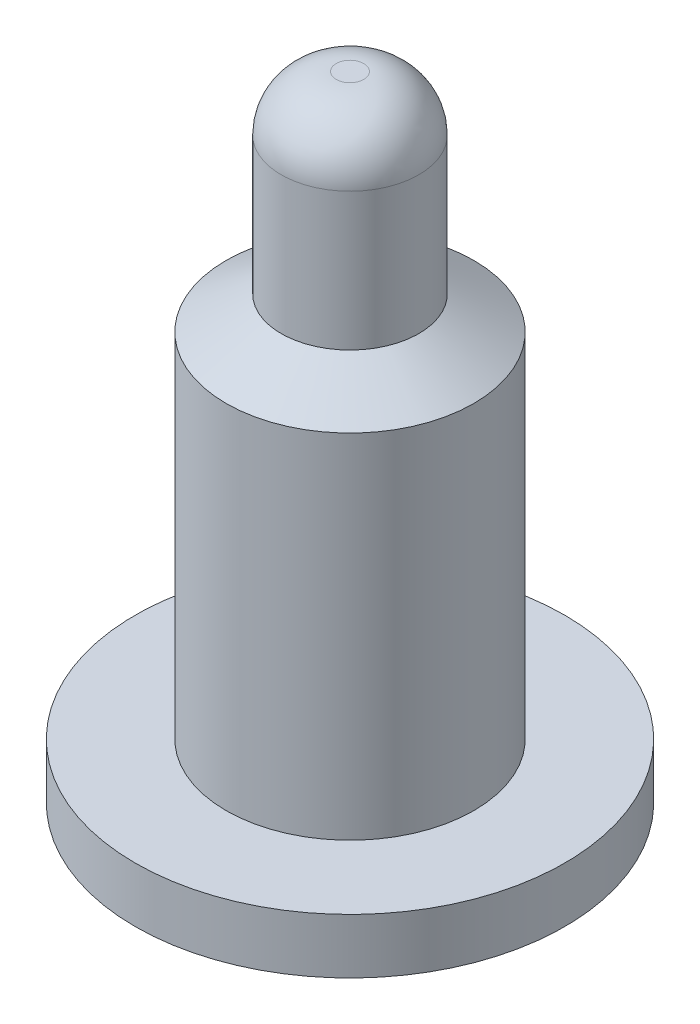
ISO-10303-21;
HEADER;
FILE_DESCRIPTION(('STEP AP214'),'2;1');
FILE_NAME('part.step','',(''),(''),'','','');
FILE_SCHEMA(('AUTOMOTIVE_DESIGN { 1 0 10303 214 1 1 1 1 }'));
ENDSEC;
DATA;
#1=APPLICATION_CONTEXT('core data for automotive mechanical design processes');
#2=APPLICATION_PROTOCOL_DEFINITION('international standard','automotive_design',2000,#1);
#3=PRODUCT_CONTEXT('',#1,'mechanical');
#4=PRODUCT('Part','Part','',(#3));
#5=PRODUCT_RELATED_PRODUCT_CATEGORY('part','',(#4));
#6=PRODUCT_DEFINITION_FORMATION('','',#4);
#7=PRODUCT_DEFINITION_CONTEXT('part definition',#1,'design');
#8=PRODUCT_DEFINITION('design','',#6,#7);
#9=PRODUCT_DEFINITION_SHAPE('','',#8);
#10=(LENGTH_UNIT() NAMED_UNIT(*) SI_UNIT(.MILLI.,.METRE.));
#11=(NAMED_UNIT(*) PLANE_ANGLE_UNIT() SI_UNIT($,.RADIAN.));
#12=(NAMED_UNIT(*) SI_UNIT($,.STERADIAN.) SOLID_ANGLE_UNIT());
#13=UNCERTAINTY_MEASURE_WITH_UNIT(LENGTH_MEASURE(1.E-05),#10,'distance_accuracy_value','');
#14=(GEOMETRIC_REPRESENTATION_CONTEXT(3) GLOBAL_UNCERTAINTY_ASSIGNED_CONTEXT((#13)) GLOBAL_UNIT_ASSIGNED_CONTEXT((#10,
#11,#12)) REPRESENTATION_CONTEXT('',''));
#15=CARTESIAN_POINT('',(0.,0.,0.));
#16=DIRECTION('',(0.,0.,1.));
#17=DIRECTION('',(1.,0.,0.));
#18=AXIS2_PLACEMENT_3D('',#15,#16,#17);
#19=CARTESIAN_POINT('',(0.,7.,0.));
#20=DIRECTION('',(0.,-1.,0.));
#21=DIRECTION('',(0.,0.,-1.));
#22=AXIS2_PLACEMENT_3D('',#19,#20,#21);
#23=PLANE('',#22);
#24=CARTESIAN_POINT('',(0.,7.0000000000004,0.125));
#25=CARTESIAN_POINT('',(-0.0011845763240586,6.99999999988191,0.124990961362247));
#26=CARTESIAN_POINT('',(-0.00236915464220974,6.9999999997948,0.124969367235018));
#27=CARTESIAN_POINT('',(-0.00467396676152806,6.99999999967586,0.124898871048834));
#28=CARTESIAN_POINT('',(-0.00579424827911599,6.99999999964133,0.124851493742099));
#29=CARTESIAN_POINT('',(-0.00838523720634593,6.99999999960475,0.124707464938616));
#30=CARTESIAN_POINT('',(-0.00985536267512346,6.99999999961635,0.124600003714444));
#31=CARTESIAN_POINT('',(-0.0131421602191902,6.9999999996706,0.124302262963767));
#32=CARTESIAN_POINT('',(-0.0149575966198639,6.99999999972,0.124098320638822));
#33=CARTESIAN_POINT('',(-0.0189275544439451,6.99999999983138,0.123564621897024));
#34=CARTESIAN_POINT('',(-0.0210798690246219,6.99999999989394,0.12321817648695));
#35=CARTESIAN_POINT('',(-0.0244224505183593,6.99999999996235,0.122590560941277));
#36=CARTESIAN_POINT('',(-0.025620031755405,6.99999999998104,0.122347561068465));
#37=CARTESIAN_POINT('',(-0.0280938146535721,7.00000000000238,0.121807885591586));
#38=CARTESIAN_POINT('',(-0.0293694505172907,7.00000000000378,0.121508601438896));
#39=CARTESIAN_POINT('',(-0.0319962853336742,6.99999999998117,0.120848718156185));
#40=CARTESIAN_POINT('',(-0.0333467876746052,6.99999999995544,0.120485347137127));
#41=CARTESIAN_POINT('',(-0.0361197149372673,6.99999999986729,0.119689274592767));
#42=CARTESIAN_POINT('',(-0.0375413002313309,6.99999999980266,0.119253644931036));
#43=CARTESIAN_POINT('',(-0.0404519786717943,6.99999999962623,0.118304701302308));
#44=CARTESIAN_POINT('',(-0.0419400685095645,6.99999999951187,0.117788310608784));
#45=CARTESIAN_POINT('',(-0.0449786525532337,6.99999999921463,0.116669335696142));
#46=CARTESIAN_POINT('',(-0.0465279685039721,6.99999999902827,0.116063542344182));
#47=CARTESIAN_POINT('',(-0.0489005381865657,6.99999999870806,0.115080643741477));
#48=CARTESIAN_POINT('',(-0.0497328176482096,6.999999998589,0.114725175860613));
#49=CARTESIAN_POINT('',(-0.0513893625458782,6.99999999836219,0.113995963399204));
#50=CARTESIAN_POINT('',(-0.0522136277080706,6.99999999825443,0.113622218196771));
#51=CARTESIAN_POINT('',(-0.0546738419752109,6.99999999795161,0.112473906613656));
#52=CARTESIAN_POINT('',(-0.0562972461882234,6.99999999777697,0.111672249208305));
#53=CARTESIAN_POINT('',(-0.0595072112858007,6.9999999975202,0.109998300300352));
#54=CARTESIAN_POINT('',(-0.0610937710172099,6.99999999743809,0.109126006590805));
#55=CARTESIAN_POINT('',(-0.0642270161640972,6.9999999973804,0.107312469694172));
#56=CARTESIAN_POINT('',(-0.0657737013124425,6.99999999740482,0.10637122604533));
#57=CARTESIAN_POINT('',(-0.0688241401012372,6.99999999755604,0.104421635492604));
#58=CARTESIAN_POINT('',(-0.0703278945079322,6.99999999768284,0.103413289787456));
#59=CARTESIAN_POINT('',(-0.0732895447011516,6.99999999801512,0.101331485761408));
#60=CARTESIAN_POINT('',(-0.0747474424301756,6.9999999982206,0.100258030204234));
#61=CARTESIAN_POINT('',(-0.0776144747865431,6.99999999866673,0.0980480662654198));
#62=CARTESIAN_POINT('',(-0.0790236126733884,6.99999999890739,0.0969115621117316));
#63=CARTESIAN_POINT('',(-0.0817905532499704,6.99999999936284,0.0945779237775702));
#64=CARTESIAN_POINT('',(-0.0831483606272363,6.99999999957763,0.0933807951568281));
#65=CARTESIAN_POINT('',(-0.0858093041461507,6.99999999989412,0.0909275676615827));
#66=CARTESIAN_POINT('',(-0.0871124466175158,6.99999999999583,0.0896714756504126));
#67=CARTESIAN_POINT('',(-0.089654805556031,7.00000000000493,0.087114716257146));
#68=CARTESIAN_POINT('',(-0.0908944237664505,6.99999999991374,0.0858144475884495));
#69=CARTESIAN_POINT('',(-0.093320504127623,6.9999999998582,0.0831653253676784));
#70=CARTESIAN_POINT('',(-0.094506968019664,6.99999999989383,0.0818164734097643));
#71=CARTESIAN_POINT('',(-0.0968242369406126,6.99999999999718,0.0790715661815917));
#72=CARTESIAN_POINT('',(-0.0979550371830363,7.00000000006491,0.0776755068693528));
#73=CARTESIAN_POINT('',(-0.100159443243098,6.99999999974125,0.0748384860651377));
#74=CARTESIAN_POINT('',(-0.101233037320516,6.99999999934977,0.0733975154516106));
#75=CARTESIAN_POINT('',(-0.103321280511592,6.99999999726854,0.0704727822091094));
#76=CARTESIAN_POINT('',(-0.104335910475358,6.99999999557838,0.0689890059095889));
#77=CARTESIAN_POINT('',(-0.10630479794021,6.99999998950278,0.065980961195197));
#78=CARTESIAN_POINT('',(-0.10725902859527,6.99999998511616,0.064456675196236));
#79=CARTESIAN_POINT('',(-0.109105052034446,6.99999997248513,0.061369676735883));
#80=CARTESIAN_POINT('',(-0.109996809575706,6.99999996423855,0.0598069432461768));
#81=CARTESIAN_POINT('',(-0.11171850094258,6.9999999399989,0.0566461857423396));
#82=CARTESIAN_POINT('',(-0.11254839245982,6.99999992400058,0.0550481385290861));
#83=CARTESIAN_POINT('',(-0.11373987692198,6.99999989753268,0.0526245992171599));
#84=CARTESIAN_POINT('',(-0.11412826067706,6.99999988829499,0.0518120801598112));
#85=CARTESIAN_POINT('',(-0.114896803551761,6.99999985985858,0.0501824328824294));
#86=CARTESIAN_POINT('',(-0.115276959087988,6.9999998406556,0.0493653028421262));
#87=CARTESIAN_POINT('',(-0.115877739026522,6.9999998297595,0.0479699222870799));
#88=CARTESIAN_POINT('',(-0.116110996847834,6.99999983132602,0.0473971515457563));
#89=CARTESIAN_POINT('',(-0.116814567970092,6.99999983945525,0.0456214752827771));
#90=CARTESIAN_POINT('',(-0.117266497309626,6.99999984960056,0.044411413422559));
#91=CARTESIAN_POINT('',(-0.118356326708186,6.99999987511897,0.0413436488613062));
#92=CARTESIAN_POINT('',(-0.118968545772131,6.99999989046378,0.0394767696078323));
#93=CARTESIAN_POINT('',(-0.120087667556273,6.99999991900967,0.0357639074901598));
#94=CARTESIAN_POINT('',(-0.120596868470112,6.99999993225562,0.0339186165126956));
#95=CARTESIAN_POINT('',(-0.121330630140748,6.99999995055333,0.0309974676448174));
#96=CARTESIAN_POINT('',(-0.121584027797007,6.99999995669174,0.0299287721797843));
#97=CARTESIAN_POINT('',(-0.122082580470595,6.99999996839581,0.0276930973950104));
#98=CARTESIAN_POINT('',(-0.12232516806938,6.99999997386731,0.0265255440863818));
#99=CARTESIAN_POINT('',(-0.122831097422406,6.99999998415258,0.0239072017143752));
#100=CARTESIAN_POINT('',(-0.123085778100579,6.99999998850474,0.0224547340366339));
#101=CARTESIAN_POINT('',(-0.123531896262788,6.99999999461784,0.0196360034349208));
#102=CARTESIAN_POINT('',(-0.123726350165895,6.99999999652759,0.0182702122010476));
#103=CARTESIAN_POINT('',(-0.124210627791376,7.00000000001083,0.0144465917821842));
#104=CARTESIAN_POINT('',(-0.124453604628784,7.00000000011367,0.0119826264115812));
#105=CARTESIAN_POINT('',(-0.124752108663787,6.9999999998358,0.00781070202283271));
#106=CARTESIAN_POINT('',(-0.124842390484822,6.99999999959505,0.00610506987974079));
#107=CARTESIAN_POINT('',(-0.12495789277335,6.99999999974292,0.00293285942866736));
#108=CARTESIAN_POINT('',(-0.124990502143336,7.00000000004744,0.00146654632544861));
#109=CARTESIAN_POINT('',(-0.12501177615309,6.99999999994207,-0.00181833382563368));
#110=CARTESIAN_POINT('',(-0.124988023219213,6.99999999934327,-0.00363702618135456));
#111=CARTESIAN_POINT('',(-0.124856913595364,6.99999999721432,-0.00727199614741167));
#112=CARTESIAN_POINT('',(-0.124749531331044,6.99999999568387,-0.00908827284880145));
#113=CARTESIAN_POINT('',(-0.124454707859988,6.99999999211747,-0.01271476160528));
#114=CARTESIAN_POINT('',(-0.124267245236631,6.99999999008138,-0.0145249719073591));
#115=CARTESIAN_POINT('',(-0.12381169283881,6.99999998579495,-0.0181356607158447));
#116=CARTESIAN_POINT('',(-0.12354358458493,6.99999998354455,-0.01993613689538));
#117=CARTESIAN_POINT('',(-0.122927489420184,6.99999997909643,-0.0235237164748269));
#118=CARTESIAN_POINT('',(-0.122579487257776,6.99999997689872,-0.0253108172540613));
#119=CARTESIAN_POINT('',(-0.121804212715411,6.99999997276904,-0.0288680295791156));
#120=CARTESIAN_POINT('',(-0.121376928229742,6.99999997083711,-0.030638138486957));
#121=CARTESIAN_POINT('',(-0.120443946239791,6.99999996740612,-0.0341577855203438));
#122=CARTESIAN_POINT('',(-0.119938239755309,6.99999996590711,-0.0359073212653162));
#123=CARTESIAN_POINT('',(-0.118849413358962,6.99999996346099,-0.0393822823917395));
#124=CARTESIAN_POINT('',(-0.118266287536528,6.99999996251392,-0.0411077059212189));
#125=CARTESIAN_POINT('',(-0.117023790355667,6.9999999612432,-0.0445309528536316));
#126=CARTESIAN_POINT('',(-0.116364416086154,6.99999996091957,-0.0462287751999555));
#127=CARTESIAN_POINT('',(-0.114970748155263,6.99999996091957,-0.0495933872826275));
#128=CARTESIAN_POINT('',(-0.114236454493886,6.9999999612432,-0.0512601770189756));
#129=CARTESIAN_POINT('',(-0.112694431481029,6.99999996251392,-0.054559356253058));
#130=CARTESIAN_POINT('',(-0.111886704935138,6.99999996346098,-0.0561917470621108));
#131=CARTESIAN_POINT('',(-0.11019945314434,6.99999996590712,-0.0594188324198195));
#132=CARTESIAN_POINT('',(-0.109319933388345,6.99999996740614,-0.0610135298383046));
#133=CARTESIAN_POINT('',(-0.107490884040403,6.99999997083709,-0.0641620130727789));
#134=CARTESIAN_POINT('',(-0.106541362481924,6.99999997276896,-0.0657158035555962));
#135=CARTESIAN_POINT('',(-0.104574238972924,6.99999997689879,-0.0687793379140028));
#136=CARTESIAN_POINT('',(-0.103556647446824,6.9999999790967,-0.0702890884833609));
#137=CARTESIAN_POINT('',(-0.101455477377251,6.99999998354428,-0.073261522285771));
#138=CARTESIAN_POINT('',(-0.100371911475743,6.99999998579395,-0.0747242144545324));
#139=CARTESIAN_POINT('',(-0.098140942706995,6.99999999008239,-0.0775995301168326));
#140=CARTESIAN_POINT('',(-0.096993554532334,6.99999999212122,-0.0790121650125156));
#141=CARTESIAN_POINT('',(-0.0946375264377593,6.99999999568012,-0.0817847689313832));
#142=CARTESIAN_POINT('',(-0.0934289029869628,6.99999999720032,-0.0831447519434289));
#143=CARTESIAN_POINT('',(-0.0909519896390017,6.99999999935726,-0.08580845335434));
#144=CARTESIAN_POINT('',(-0.0896837181028242,6.99999999999426,-0.0871121888335506));
#145=CARTESIAN_POINT('',(-0.0871163337875572,7.00000000000642,-0.089641496270993));
#146=CARTESIAN_POINT('',(-0.0858181894298551,6.99999999940413,-0.0908680537236018));
#147=CARTESIAN_POINT('',(-0.0831751397817974,6.99999999817731,-0.0932690667318865));
#148=CARTESIAN_POINT('',(-0.0818302452150231,6.99999999755278,-0.0944435340971621));
#149=CARTESIAN_POINT('',(-0.0790948081053531,6.99999999686783,-0.0967378380313501));
#150=CARTESIAN_POINT('',(-0.0777042694153862,6.99999999680735,-0.0978576791916524));
#151=CARTESIAN_POINT('',(-0.0748797479053537,6.99999999733549,-0.100041308550285));
#152=CARTESIAN_POINT('',(-0.0734457625029252,6.99999999792415,-0.101105093406435));
#153=CARTESIAN_POINT('',(-0.07053643596607,6.99999999908489,-0.103175243349613));
#154=CARTESIAN_POINT('',(-0.0690610864834311,6.99999999965698,-0.104181596719432));
#155=CARTESIAN_POINT('',(-0.0660707805647611,7.00000000025959,-0.106134564816066));
#156=CARTESIAN_POINT('',(-0.0645558105643215,7.00000000028993,-0.10708115869484));
#157=CARTESIAN_POINT('',(-0.0614897685244681,6.99999999610883,-0.108916425643709));
#158=CARTESIAN_POINT('',(-0.0599386791424029,6.99999999189532,-0.109805070077456));
#159=CARTESIAN_POINT('',(-0.0567974878541885,6.99999998473228,-0.11151103925575));
#160=CARTESIAN_POINT('',(-0.0552073618461242,6.99999998178354,-0.11232831844315));
#161=CARTESIAN_POINT('',(-0.0520093790933695,6.99999994561689,-0.113935331696741));
#162=CARTESIAN_POINT('',(-0.0504015095353135,6.99999991237545,-0.114725043873401));
#163=CARTESIAN_POINT('',(-0.0483574549431161,6.99999991698706,-0.115580670707735));
#164=CARTESIAN_POINT('',(-0.047961409967924,6.99999991997773,-0.115739816049636));
#165=CARTESIAN_POINT('',(-0.0464378152247606,6.99999993068556,-0.116344151016213));
#166=CARTESIAN_POINT('',(-0.0453053779900423,6.99999993697224,-0.116776764113934));
#167=CARTESIAN_POINT('',(-0.0422908000548951,6.99999995312389,-0.117876563667241));
#168=CARTESIAN_POINT('',(-0.0403978014923146,6.99999996267137,-0.118514354341029));
#169=CARTESIAN_POINT('',(-0.0365693927194749,6.99999997842303,-0.119703589639662));
#170=CARTESIAN_POINT('',(-0.0346337709455264,6.99999998460162,-0.120254351084104));
#171=CARTESIAN_POINT('',(-0.0315523864108214,6.9999999920339,-0.12105114395142));
#172=CARTESIAN_POINT('',(-0.0304146074382847,6.99999999426668,-0.121328331566643));
#173=CARTESIAN_POINT('',(-0.0280245159312249,6.99999999782931,-0.121874805571143));
#174=CARTESIAN_POINT('',(-0.0267714739396776,6.99999999905479,-0.122140910123186));
#175=CARTESIAN_POINT('',(-0.0241188215030493,7.00000000023349,-0.122663275358711));
#176=CARTESIAN_POINT('',(-0.0227183536791854,7.0000000000307,-0.122915178859951));
#177=CARTESIAN_POINT('',(-0.0199850187174355,6.99999999886957,-0.123363069949293));
#178=CARTESIAN_POINT('',(-0.0186525184422735,6.999999997952,-0.123561319158935));
#179=CARTESIAN_POINT('',(-0.0148714576697602,6.99999999545753,-0.124067257454162));
#180=CARTESIAN_POINT('',(-0.012416541567566,6.99999999396708,-0.124328804125145));
#181=CARTESIAN_POINT('',(-0.0082048028349713,6.99999999457408,-0.124668544127081));
#182=CARTESIAN_POINT('',(-0.00645035497895921,6.99999999576257,-0.124777840564063));
#183=CARTESIAN_POINT('',(-0.00313051930415646,6.99999999815936,-0.124928034492128));
#184=CARTESIAN_POINT('',(-0.0015654110968393,6.99999999935131,-0.12497509870089));
#185=CARTESIAN_POINT('',(0.,7.0000000000004,-0.125));
#186=B_SPLINE_CURVE_WITH_KNOTS('',3,(#24,#25,#26,#27,#28,#29,#30,#31,#32,#33,#34,#35,#36,#37,
#38,#39,#40,#41,#42,#43,#44,#45,#46,#47,#48,#49,#50,#51,#52,#53,#54,#55,#56,#57,#58,#59,#60,#61,
#62,#63,#64,#65,#66,#67,#68,#69,#70,#71,#72,#73,#74,#75,#76,#77,#78,#79,#80,#81,#82,#83,#84,#85,
#86,#87,#88,#89,#90,#91,#92,#93,#94,#95,#96,#97,#98,#99,#100,#101,#102,#103,#104,#105,#106,#107,
#108,#109,#110,#111,#112,#113,#114,#115,#116,#117,#118,#119,#120,#121,#122,#123,#124,#125,#126,
#127,#128,#129,#130,#131,#132,#133,#134,#135,#136,#137,#138,#139,#140,#141,#142,#143,#144,#145,
#146,#147,#148,#149,#150,#151,#152,#153,#154,#155,#156,#157,#158,#159,#160,#161,#162,#163,#164,
#165,#166,#167,#168,#169,#170,#171,#172,#173,#174,#175,#176,#177,#178,#179,#180,#181,#182,#183,
#184,#185),.UNSPECIFIED.,.F.,.F.,(4,2,2,2,2,2,2,2,2,2,2,2,2,2,2,2,2,2,2,2,2,2,2,2,2,2,2,2,2,2,2,
2,2,2,2,2,2,2,2,2,2,2,2,2,2,2,2,2,2,2,2,2,2,2,2,2,2,2,2,2,2,2,2,2,2,2,2,2,2,2,2,2,2,2,2,2,2,2,2,
2,4),(0.,0.00355390411559182,0.00691743798368023,0.0113386471174511,0.0168175827364344,
0.0233543627285268,0.0270198879525032,0.0309500404898857,0.0351448672752296,0.0396044203684168,
0.0443287569566394,0.0493179393557704,0.0520327805529687,0.0547477141870433,0.0601774635948827,
0.065607382714166,0.0710373382008164,0.0764671967106953,0.0818968248998665,0.0873260894248601,
0.0927548569429374,0.098182994112356,0.103570956874667,0.108958743002874,0.114346991617169,
0.119736341816988,0.125127432655956,0.130520903116892,0.13591739208692,0.141317538332715,
0.144019321234146,0.146722258006213,0.148577240067705,0.152451695231184,0.158343375423983,
0.164083964140989,0.167378598079147,0.170955578819889,0.175378552177074,0.179516713680765,
0.186940183340825,0.19206332276448,0.196462786404626,0.201917570486593,0.207374023329347,
0.212831936355501,0.218291100980567,0.223751308613983,0.229212350660132,0.234674018519359,
0.240136103588984,0.245598397264312,0.251060690939641,0.256522776009267,0.261984443868495,
0.267445485914645,0.272905693548063,0.278364858173132,0.283822771199289,0.289279224042046,
0.294734008124016,0.300090437966607,0.30544564715337,0.310800405450874,0.316155482648512,
0.32151164851493,0.326869672754487,0.332230324963836,0.337594374588694,0.342962590880901,
0.344242898668081,0.347879380970134,0.353869438706628,0.359904403721428,0.363417152122189,
0.367259506767069,0.371527572630726,0.375568600504453,0.382971094944192,0.388243687709725,
0.392940409915569),.UNSPECIFIED.);
#187=CARTESIAN_POINT('',(0.,7.0000000000004,0.125));
#188=VERTEX_POINT('',#187);
#189=CARTESIAN_POINT('',(3.86355083801407E-09,7.00000000000037,-0.124999999937322));
#190=VERTEX_POINT('',#189);
#191=EDGE_CURVE('E35',#188,#190,#186,.T.);
#192=ORIENTED_EDGE('',*,*,#191,.F.);
#193=CARTESIAN_POINT('',(0.,7.0000000000004,-0.125));
#194=CARTESIAN_POINT('',(0.000863166943270553,6.99999999991643,-0.124993122554638));
#195=CARTESIAN_POINT('',(0.00172638667744423,6.99999999984802,-0.124979642854253));
#196=CARTESIAN_POINT('',(0.00439679475173449,6.9999999996791,-0.124915111537449));
#197=CARTESIAN_POINT('',(0.00620346743626927,6.99999999962535,-0.124839088510162));
#198=CARTESIAN_POINT('',(0.00926319873397888,6.99999999960966,-0.124643234697517));
#199=CARTESIAN_POINT('',(0.0105175730129968,6.99999999962478,-0.124543750114273));
#200=CARTESIAN_POINT('',(0.0132579884125726,6.99999999967546,-0.12428561518772));
#201=CARTESIAN_POINT('',(0.0147433184910543,6.99999999971432,-0.124119364247846));
#202=CARTESIAN_POINT('',(0.0179413727134722,6.99999999980303,-0.123703603183831));
#203=CARTESIAN_POINT('',(0.0196529308406049,6.99999999985363,-0.123445086557312));
#204=CARTESIAN_POINT('',(0.0232967796132941,6.9999999999433,-0.122817538369758));
#205=CARTESIAN_POINT('',(0.0252273078431152,6.99999999997986,-0.122438237906049));
#206=CARTESIAN_POINT('',(0.0292991447207724,7.00000000000983,-0.121538316288853));
#207=CARTESIAN_POINT('',(0.031437912589598,6.99999999999754,-0.12100619165966));
#208=CARTESIAN_POINT('',(0.0359124311349919,6.99999999988601,-0.119766824104908));
#209=CARTESIAN_POINT('',(0.0382446990156076,6.99999999977758,-0.119046918701741));
#210=CARTESIAN_POINT('',(0.041792228297626,6.99999999952001,-0.117837320643738));
#211=CARTESIAN_POINT('',(0.043024078645989,6.99999999941304,-0.117395623935314));
#212=CARTESIAN_POINT('',(0.0455287617709962,6.99999999914914,-0.116453089072085));
#213=CARTESIAN_POINT('',(0.0468009306706703,6.99999999899016,-0.115950480247219));
#214=CARTESIAN_POINT('',(0.0494325667083838,6.99999999863762,-0.114860215921872));
#215=CARTESIAN_POINT('',(0.0507905449628178,6.99999999844228,-0.114268964430852));
#216=CARTESIAN_POINT('',(0.0534843659722467,6.99999999809111,-0.113037849431325));
#217=CARTESIAN_POINT('',(0.0548202076321696,6.99999999793529,-0.112397983526611));
#218=CARTESIAN_POINT('',(0.0574680515097069,6.99999999767597,-0.111070591384003));
#219=CARTESIAN_POINT('',(0.0587800529420403,6.99999999757246,-0.110383063579737));
#220=CARTESIAN_POINT('',(0.0613784796106221,6.99999999743318,-0.108961215546125));
#221=CARTESIAN_POINT('',(0.0626649044260574,6.99999999739741,-0.108226894547724));
#222=CARTESIAN_POINT('',(0.0652104922312693,6.99999999739731,-0.106712430149247));
#223=CARTESIAN_POINT('',(0.0664696552210426,6.99999999743298,-0.105932286749165));
#224=CARTESIAN_POINT('',(0.068959067666152,6.99999999757162,-0.104327200555979));
#225=CARTESIAN_POINT('',(0.0701893175964556,6.99999999767459,-0.10350225849954));
#226=CARTESIAN_POINT('',(0.0726192849406385,6.9999999979347,-0.10180865368851));
#227=CARTESIAN_POINT('',(0.0738190033570518,6.99999999809183,-0.100939992372284));
#228=CARTESIAN_POINT('',(0.076186357023123,6.99999999843894,-0.0991601133166216));
#229=CARTESIAN_POINT('',(0.077353993852185,6.99999999862891,-0.0982488976781559));
#230=CARTESIAN_POINT('',(0.07965557410639,6.99999999900998,-0.0963850286247508));
#231=CARTESIAN_POINT('',(0.0807895197422413,6.99999999920108,-0.0954323779387983));
#232=CARTESIAN_POINT('',(0.0830225367678941,6.99999999955039,-0.0934871972742383));
#233=CARTESIAN_POINT('',(0.0841216110169821,6.99999999970862,-0.092494670580475));
#234=CARTESIAN_POINT('',(0.0862823185965877,6.9999999999256,-0.0904699158492117));
#235=CARTESIAN_POINT('',(0.0873439556102447,6.99999999998437,-0.0894376917382181));
#236=CARTESIAN_POINT('',(0.0894414245094089,7.00000000001656,-0.0873302775557568));
#237=CARTESIAN_POINT('',(0.0904769683952516,6.99999999998927,-0.0862548015721313));
#238=CARTESIAN_POINT('',(0.0925162467687964,7.00000000000659,-0.0840740383568251));
#239=CARTESIAN_POINT('',(0.0935199779713686,7.00000000005121,-0.0829687480680509));
#240=CARTESIAN_POINT('',(0.096482365127324,6.99999999829381,-0.0796070830881871));
#241=CARTESIAN_POINT('',(0.0983910959860125,6.99999999459849,-0.0773060404290494));
#242=CARTESIAN_POINT('',(0.100916315182364,6.99999997053877,-0.074064435950632));
#243=CARTESIAN_POINT('',(0.101595323399934,6.99999996202695,-0.0731717720486683));
#244=CARTESIAN_POINT('',(0.102937012441274,6.99999993539225,-0.0713730418533025));
#245=CARTESIAN_POINT('',(0.103599680410243,6.99999991726205,-0.0704669658523778));
#246=CARTESIAN_POINT('',(0.104890875233769,6.99999988254626,-0.0686318059807541));
#247=CARTESIAN_POINT('',(0.10551943096373,6.99999986595936,-0.0677027425700496));
#248=CARTESIAN_POINT('',(0.106962692179925,6.9999998368789,-0.0654797609207533));
#249=CARTESIAN_POINT('',(0.107762070706407,6.99999982806134,-0.0641759082919027));
#250=CARTESIAN_POINT('',(0.109300649928862,6.99999981593216,-0.0615475683497284));
#251=CARTESIAN_POINT('',(0.110040285280359,6.99999981257656,-0.0602233334246623));
#252=CARTESIAN_POINT('',(0.111588925032127,6.99999981025265,-0.0573163690176891));
#253=CARTESIAN_POINT('',(0.112388005797892,6.99999981213745,-0.0557283266879685));
#254=CARTESIAN_POINT('',(0.113574542312409,6.99999981775329,-0.0532325594304127));
#255=CARTESIAN_POINT('',(0.113986931504182,6.99999982028949,-0.0523365695522751));
#256=CARTESIAN_POINT('',(0.114815818056172,6.99999982650197,-0.0504751807165594));
#257=CARTESIAN_POINT('',(0.115230791871728,6.99999983024241,-0.0495091020576889));
#258=CARTESIAN_POINT('',(0.116211293183689,6.99999983986998,-0.0471426751345965));
#259=CARTESIAN_POINT('',(0.116763496657755,6.9999998459816,-0.045736788652845));
#260=CARTESIAN_POINT('',(0.117815873185168,6.99999985844034,-0.0429060016526651));
#261=CARTESIAN_POINT('',(0.118316056095821,6.99999986478741,-0.0414811047944351));
#262=CARTESIAN_POINT('',(0.119263579643869,6.99999987770632,-0.0386141765469225));
#263=CARTESIAN_POINT('',(0.119710931472764,6.99999988427812,-0.0371721488580495));
#264=CARTESIAN_POINT('',(0.12055223900762,6.99999989744788,-0.0342729694738468));
#265=CARTESIAN_POINT('',(0.120946207216323,6.99999990404585,-0.0328158214061622));
#266=CARTESIAN_POINT('',(0.121680219529229,6.999999917099,-0.029888403713149));
#267=CARTESIAN_POINT('',(0.122020277467061,6.99999992355423,-0.0284181375566025));
#268=CARTESIAN_POINT('',(0.122646035054073,6.99999993612452,-0.02546651160003));
#269=CARTESIAN_POINT('',(0.122931749866972,6.99999994223967,-0.0239851550149066));
#270=CARTESIAN_POINT('',(0.123448445543761,6.99999995391897,-0.0210133888850317));
#271=CARTESIAN_POINT('',(0.123679442905277,6.99999995948327,-0.0195229822082915));
#272=CARTESIAN_POINT('',(0.1240864633733,6.99999996983463,-0.0165351688573918));
#273=CARTESIAN_POINT('',(0.124262504286569,6.99999997462194,-0.0150377646105006));
#274=CARTESIAN_POINT('',(0.124559237955474,6.99999998317037,-0.0120380181468791));
#275=CARTESIAN_POINT('',(0.124679949886661,6.99999998693185,-0.0105356778229445));
#276=CARTESIAN_POINT('',(0.124866518883254,6.99999999318823,-0.00752812567299008));
#277=CARTESIAN_POINT('',(0.124932396192333,6.99999999568361,-0.00602291511247129));
#278=CARTESIAN_POINT('',(0.125006925686117,6.99999999905828,-0.00301169706473733));
#279=CARTESIAN_POINT('',(0.125015600285468,6.99999999993821,-0.00150569012095554));
#280=CARTESIAN_POINT('',(0.124984539785432,7.00000000006202,0.00149217092147095));
#281=CARTESIAN_POINT('',(0.124945238644796,6.99999999932052,0.00298403068391338));
#282=CARTESIAN_POINT('',(0.124828052134095,6.99999999847518,0.00596598968917987));
#283=CARTESIAN_POINT('',(0.124750172415718,6.99999999837125,0.00745608915784155));
#284=CARTESIAN_POINT('',(0.124453021197236,7.00000000085231,0.0119235933838346));
#285=CARTESIAN_POINT('',(0.124170250369353,7.00000000623272,0.0148968857895807));
#286=CARTESIAN_POINT('',(0.123546336969425,6.9999999792848,0.0200884067885625));
#287=CARTESIAN_POINT('',(0.123237211307642,6.99999995600362,0.0223104802022534));
#288=CARTESIAN_POINT('',(0.122809993871473,6.99999991080992,0.0248519133195656));
#289=CARTESIAN_POINT('',(0.122753167807147,6.99999990458909,0.0251814428332456));
#290=CARTESIAN_POINT('',(0.122532362310214,6.99999988455477,0.0263993416716351));
#291=CARTESIAN_POINT('',(0.122350590588389,6.99999987583415,0.0272844776603322));
#292=CARTESIAN_POINT('',(0.121896361194904,6.99999985913531,0.0293552295575306));
#293=CARTESIAN_POINT('',(0.121614304762342,6.99999985246134,0.0305386903504796));
#294=CARTESIAN_POINT('',(0.120932408372668,6.99999984234671,0.0331986160410235));
#295=CARTESIAN_POINT('',(0.120520936956798,6.99999984018009,0.0346721082925309));
#296=CARTESIAN_POINT('',(0.11955008662792,6.99999983937796,0.0379014113260781));
#297=CARTESIAN_POINT('',(0.118977669957856,6.99999984155548,0.0396533110660198));
#298=CARTESIAN_POINT('',(0.118019701408811,6.99999984740007,0.0423703291914659));
#299=CARTESIAN_POINT('',(0.117661588645115,6.99999985000269,0.0433452224690179));
#300=CARTESIAN_POINT('',(0.116892311300894,6.99999985620973,0.0453583817165684));
#301=CARTESIAN_POINT('',(0.116479182383707,6.99999985987477,0.0463958984201749));
#302=CARTESIAN_POINT('',(0.115474342090932,6.99999986886642,0.0488224831669427));
#303=CARTESIAN_POINT('',(0.114870961836837,6.99999987432374,0.0502067319154688));
#304=CARTESIAN_POINT('',(0.1136141563134,6.99999988528882,0.0529519893391139));
#305=CARTESIAN_POINT('',(0.112960740373601,6.99999989079656,0.0543130022891306));
#306=CARTESIAN_POINT('',(0.111604618697167,6.99999990186738,0.0570099063273133));
#307=CARTESIAN_POINT('',(0.110901923015575,6.99999990743044,0.0583458024701812));
#308=CARTESIAN_POINT('',(0.10944825650365,6.99999991846213,0.0609906794980081));
#309=CARTESIAN_POINT('',(0.108697296371765,6.99999992393079,0.0622996662634568));
#310=CARTESIAN_POINT('',(0.107148130625508,6.99999993465292,0.0648889544918524));
#311=CARTESIAN_POINT('',(0.10634993631564,6.99999993990643,0.066169262718096));
#312=CARTESIAN_POINT('',(0.104707413532531,6.99999995005743,0.068699470830262));
#313=CARTESIAN_POINT('',(0.10386309691474,6.99999995495501,0.0699493784122064));
#314=CARTESIAN_POINT('',(0.102129491273022,6.99999996424585,0.0724170946233769));
#315=CARTESIAN_POINT('',(0.101240214604689,6.99999996863926,0.0736349119329725));
#316=CARTESIAN_POINT('',(0.0994179496871989,6.99999997676449,0.0760368387240279));
#317=CARTESIAN_POINT('',(0.0984849742262312,6.9999999804965,0.0772209579059781));
#318=CARTESIAN_POINT('',(0.0965764982260118,6.9999999871264,0.0795537929777814));
#319=CARTESIAN_POINT('',(0.0956010108882914,6.99999999002454,0.0807025196718281));
#320=CARTESIAN_POINT('',(0.093609257296348,6.99999999482543,0.0829634253108544));
#321=CARTESIAN_POINT('',(0.0925930044350816,6.99999999672849,0.0840756160443065));
#322=CARTESIAN_POINT('',(0.0905196529292297,6.99999999928937,0.0862604887620846));
#323=CARTESIAN_POINT('',(0.0894625684324707,6.99999999994762,0.0873331841840019));
#324=CARTESIAN_POINT('',(0.0873331048622698,7.00000000005225,0.0894248697955798));
#325=CARTESIAN_POINT('',(0.0862613259256151,6.99999999951984,0.0904444739789524));
#326=CARTESIAN_POINT('',(0.0840912738822803,6.99999999892999,0.0924548079260734));
#327=CARTESIAN_POINT('',(0.082993003704892,6.99999999887249,0.0934455408557763));
#328=CARTESIAN_POINT('',(0.0796550010028629,7.00000000086753,0.0963704327079158));
#329=CARTESIAN_POINT('',(0.0773729287652703,7.00000000508941,0.098256446061068));
#330=CARTESIAN_POINT('',(0.0732958043614567,6.99999998081438,0.101456025617939));
#331=CARTESIAN_POINT('',(0.0715208877637525,6.99999996019858,0.102795245681566));
#332=CARTESIAN_POINT('',(0.0694418977215665,6.99999992236562,0.104272279029597));
#333=CARTESIAN_POINT('',(0.0691740514944906,6.99999991723764,0.104460873376557));
#334=CARTESIAN_POINT('',(0.0681704899593871,6.99999990095924,0.10515488751017));
#335=CARTESIAN_POINT('',(0.06742466736233,6.99999989467791,0.105645676631368));
#336=CARTESIAN_POINT('',(0.0656535547872234,6.99999988337417,0.106778036900864));
#337=CARTESIAN_POINT('',(0.064623015558083,6.99999987958958,0.107411308179316));
#338=CARTESIAN_POINT('',(0.0622685790988306,6.99999987545439,0.108804069410094));
#339=CARTESIAN_POINT('',(0.0609385329103605,6.99999987626266,0.109553182974731));
#340=CARTESIAN_POINT('',(0.0579712432126449,6.99999988127392,0.111148496997367));
#341=CARTESIAN_POINT('',(0.0563274938313446,6.99999988614617,0.111982614500865));
#342=CARTESIAN_POINT('',(0.0537274223292125,6.99999989540885,0.113227263382399));
#343=CARTESIAN_POINT('',(0.0527835579053148,6.99999989908465,0.113664035692506));
#344=CARTESIAN_POINT('',(0.0508126780268538,6.9999999072044,0.114545145211259));
#345=CARTESIAN_POINT('',(0.049784791750518,6.99999991168551,0.114987537584186));
#346=CARTESIAN_POINT('',(0.0474491350990676,6.99999992165772,0.115955420835044));
#347=CARTESIAN_POINT('',(0.0461379486726533,6.99999992710919,0.116472687415351));
#348=CARTESIAN_POINT('',(0.0435573334988177,6.99999993706722,0.117441039128548));
#349=CARTESIAN_POINT('',(0.0422886196280057,6.99999994160489,0.11789403864713));
#350=CARTESIAN_POINT('',(0.0386383345020688,6.99999995382862,0.119131423614919));
#351=CARTESIAN_POINT('',(0.0362393650066821,6.99999996086047,0.119865210598828));
#352=CARTESIAN_POINT('',(0.0316418192544382,6.99999997245702,0.121122212727556));
#353=CARTESIAN_POINT('',(0.0294469509632849,6.99999997719716,0.121659090842227));
#354=CARTESIAN_POINT('',(0.0252741369794352,6.99999998480864,0.122561249140068));
#355=CARTESIAN_POINT('',(0.0232988649445267,6.9999999878281,0.122938904285543));
#356=CARTESIAN_POINT('',(0.0195772202817058,6.99999999249249,0.123558441194177));
#357=CARTESIAN_POINT('',(0.0178326725762468,6.99999999426104,0.123811325397057));
#358=CARTESIAN_POINT('',(0.0145804934046032,6.99999999684481,0.124213196736069));
#359=CARTESIAN_POINT('',(0.0130740435283537,6.99999999775911,0.124371793361379));
#360=CARTESIAN_POINT('',(0.0103032105694371,6.99999999899234,0.124613888815502));
#361=CARTESIAN_POINT('',(0.00903952558984582,6.99999999938416,0.124705426974255));
#362=CARTESIAN_POINT('',(0.00598647430208236,6.99999999996094,0.12487926106067));
#363=CARTESIAN_POINT('',(0.0041959911393151,6.99999999999315,0.124942053737053));
#364=CARTESIAN_POINT('',(0.0016034187619566,6.99999999999415,0.12498873350892));
#365=CARTESIAN_POINT('',(0.000801671107436464,6.99999999998814,0.124997046858904));
#366=CARTESIAN_POINT('',(0.,7.0000000000004,0.125));
#367=B_SPLINE_CURVE_WITH_KNOTS('',3,(#193,#194,#195,#196,#197,#198,#199,#200,#201,#202,#203,
#204,#205,#206,#207,#208,#209,#210,#211,#212,#213,#214,#215,#216,#217,#218,#219,#220,#221,#222,
#223,#224,#225,#226,#227,#228,#229,#230,#231,#232,#233,#234,#235,#236,#237,#238,#239,#240,#241,
#242,#243,#244,#245,#246,#247,#248,#249,#250,#251,#252,#253,#254,#255,#256,#257,#258,#259,#260,
#261,#262,#263,#264,#265,#266,#267,#268,#269,#270,#271,#272,#273,#274,#275,#276,#277,#278,#279,
#280,#281,#282,#283,#284,#285,#286,#287,#288,#289,#290,#291,#292,#293,#294,#295,#296,#297,#298,
#299,#300,#301,#302,#303,#304,#305,#306,#307,#308,#309,#310,#311,#312,#313,#314,#315,#316,#317,
#318,#319,#320,#321,#322,#323,#324,#325,#326,#327,#328,#329,#330,#331,#332,#333,#334,#335,#336,
#337,#338,#339,#340,#341,#342,#343,#344,#345,#346,#347,#348,#349,#350,#351,#352,#353,#354,#355,
#356,#357,#358,#359,#360,#361,#362,#363,#364,#365,#366),.UNSPECIFIED.,.F.,.F.,(4,2,2,2,2,2,2,2,
2,2,2,2,2,2,2,2,2,2,2,2,2,2,2,2,2,2,2,2,2,2,2,2,2,2,2,2,2,2,2,2,2,2,2,2,2,2,2,2,2,2,2,2,2,2,2,2,
2,2,2,2,2,2,2,2,2,2,2,2,2,2,2,2,2,2,2,2,2,2,2,2,2,2,2,2,2,2,4),(0.,0.00258978203932619,
0.00801301822128738,0.0117874159436722,0.0162702946908236,0.0214617367992657,0.0273618576204402,
0.033970805629812,0.0412887624796163,0.0452141658012404,0.0493169729865891,0.0537593392844036,
0.0582019246888981,0.0626446561648417,0.0670874606768143,0.0715302651893033,0.0759729966668006,
0.0804155820738996,0.0848579483753921,0.0893000225363649,0.0937417315222976,0.0981830022991594,
0.10266120523297,0.10713986911062,0.11610195200049,0.119466556991851,0.122833729506336,
0.12619800582855,0.130784449751983,0.135333776268436,0.140664941016271,0.14362370682505,
0.146777652173698,0.151307919315944,0.155837326453938,0.160365772374956,0.164893155868678,
0.169419375727431,0.173944330746443,0.178467919724086,0.182990041462134,0.187510594766014,
0.192029478445062,0.196546591312779,0.201023146200402,0.20549904547507,0.2144547926062,
0.221182795294473,0.22218594166898,0.224896080033784,0.228545281250234,0.233133579013926,
0.238660518252511,0.241775977731076,0.245125788316904,0.249654846246806,0.254183061745308,
0.258710355979464,0.26323665011771,0.267761865329978,0.272285922787814,0.276808743664499,
0.281330249135162,0.285850360376903,0.290368998568913,0.294886084892594,0.299323368947552,
0.303760164575152,0.312637337557467,0.319305286866954,0.320287998081921,0.322965793394371,
0.326593877995044,0.331172086650744,0.33669972654489,0.339819497505105,0.343176210360819,
0.347403933988751,0.35144485041477,0.358965929572749,0.365741475378682,0.371772291479712,
0.377059078985428,0.381602436506982,0.385402860260276,0.390776109352614,0.393181327494549),.UNSPECIFIED.);
#368=EDGE_CURVE('E32',#190,#188,#367,.T.);
#369=ORIENTED_EDGE('',*,*,#368,.F.);
#370=EDGE_LOOP('',(#192,#369));
#371=FACE_BOUND('',#370,.T.);
#372=ADVANCED_FACE('F15',(#371),#23,.F.);
#373=CARTESIAN_POINT('',(0.,6.50000000000004,1.16063842564573E-13));
#374=DIRECTION('',(0.,-1.,0.));
#375=DIRECTION('',(0.,0.,-1.));
#376=AXIS2_PLACEMENT_3D('',#373,#374,#375);
#377=DEGENERATE_TOROIDAL_SURFACE('',#376,0.124999999999296,0.500000000000353,.T.);
#378=CARTESIAN_POINT('',(0.,6.5,0.));
#379=DIRECTION('',(0.,-1.,0.));
#380=DIRECTION('',(0.,0.,-1.));
#381=AXIS2_PLACEMENT_3D('',#378,#379,#380);
#382=CIRCLE('',#381,0.625);
#383=CARTESIAN_POINT('',(0.,6.5,-0.625));
#384=VERTEX_POINT('',#383);
#385=EDGE_CURVE('E37',#384,#384,#382,.T.);
#386=ORIENTED_EDGE('',*,*,#385,.F.);
#387=EDGE_LOOP('',(#386));
#388=FACE_BOUND('',#387,.T.);
#389=ORIENTED_EDGE('',*,*,#191,.T.);
#390=ORIENTED_EDGE('',*,*,#368,.T.);
#391=EDGE_LOOP('',(#389,#390));
#392=FACE_BOUND('',#391,.T.);
#393=ADVANCED_FACE('F17',(#388,#392),#377,.T.);
#394=CARTESIAN_POINT('',(0.,7.35,0.));
#395=DIRECTION('',(0.,-1.,0.));
#396=DIRECTION('',(0.,0.,-1.));
#397=AXIS2_PLACEMENT_3D('',#394,#395,#396);
#398=CYLINDRICAL_SURFACE('',#397,0.625);
#399=ORIENTED_EDGE('',*,*,#385,.T.);
#400=EDGE_LOOP('',(#399));
#401=FACE_BOUND('',#400,.T.);
#402=CARTESIAN_POINT('',(0.,5.25107278832593,0.));
#403=DIRECTION('',(0.,-1.,0.));
#404=DIRECTION('',(0.,0.,-1.));
#405=AXIS2_PLACEMENT_3D('',#402,#403,#404);
#406=CIRCLE('',#405,0.624999999956799);
#407=CARTESIAN_POINT('',(0.,5.25107278832593,-0.624999999956799));
#408=VERTEX_POINT('',#407);
#409=EDGE_CURVE('E40',#408,#408,#406,.T.);
#410=ORIENTED_EDGE('',*,*,#409,.F.);
#411=EDGE_LOOP('',(#410));
#412=FACE_BOUND('',#411,.T.);
#413=ADVANCED_FACE('F70',(#401,#412),#398,.T.);
#414=CARTESIAN_POINT('',(0.,4.95115082037501,0.));
#415=DIRECTION('',(0.,-1.,0.));
#416=DIRECTION('',(0.,0.,-1.));
#417=AXIS2_PLACEMENT_3D('',#414,#415,#416);
#418=CONICAL_SURFACE('',#417,1.12630406147218,1.03163988609194);
#419=CARTESIAN_POINT('',(0.,4.95193101888749,0.));
#420=DIRECTION('',(0.,-1.,0.));
#421=DIRECTION('',(0.,0.,-1.));
#422=AXIS2_PLACEMENT_3D('',#419,#420,#421);
#423=CIRCLE('',#422,1.125);
#424=CARTESIAN_POINT('',(0.,4.95193101888749,-1.125));
#425=VERTEX_POINT('',#424);
#426=EDGE_CURVE('E20',#425,#425,#423,.T.);
#427=ORIENTED_EDGE('',*,*,#426,.F.);
#428=EDGE_LOOP('',(#427));
#429=FACE_BOUND('',#428,.T.);
#430=ORIENTED_EDGE('',*,*,#409,.T.);
#431=EDGE_LOOP('',(#430));
#432=FACE_BOUND('',#431,.T.);
#433=ADVANCED_FACE('F68',(#429,#432),#418,.T.);
#434=CARTESIAN_POINT('',(0.,7.35,0.));
#435=DIRECTION('',(0.,-1.,0.));
#436=DIRECTION('',(0.,0.,-1.));
#437=AXIS2_PLACEMENT_3D('',#434,#435,#436);
#438=CYLINDRICAL_SURFACE('',#437,1.125);
#439=CARTESIAN_POINT('',(0.,1.75,0.));
#440=DIRECTION('',(0.,-1.,0.));
#441=DIRECTION('',(0.,0.,-1.));
#442=AXIS2_PLACEMENT_3D('',#439,#440,#441);
#443=CIRCLE('',#442,1.125);
#444=CARTESIAN_POINT('',(0.,1.75,-1.125));
#445=VERTEX_POINT('',#444);
#446=EDGE_CURVE('E57',#445,#445,#443,.F.);
#447=ORIENTED_EDGE('',*,*,#446,.T.);
#448=EDGE_LOOP('',(#447));
#449=FACE_BOUND('',#448,.T.);
#450=ORIENTED_EDGE('',*,*,#426,.T.);
#451=EDGE_LOOP('',(#450));
#452=FACE_BOUND('',#451,.T.);
#453=ADVANCED_FACE('F79',(#449,#452),#438,.T.);
#454=CARTESIAN_POINT('',(0.,1.75,0.));
#455=DIRECTION('',(0.,-1.,0.));
#456=DIRECTION('',(0.,0.,-1.));
#457=AXIS2_PLACEMENT_3D('',#454,#455,#456);
#458=PLANE('',#457);
#459=ORIENTED_EDGE('',*,*,#446,.F.);
#460=EDGE_LOOP('',(#459));
#461=FACE_BOUND('',#460,.T.);
#462=CARTESIAN_POINT('',(0.,1.75,0.));
#463=DIRECTION('',(0.,-1.,0.));
#464=DIRECTION('',(0.,0.,-1.));
#465=AXIS2_PLACEMENT_3D('',#462,#463,#464);
#466=CIRCLE('',#465,1.95);
#467=CARTESIAN_POINT('',(0.,1.75,-1.95));
#468=VERTEX_POINT('',#467);
#469=EDGE_CURVE('E55',#468,#468,#466,.T.);
#470=ORIENTED_EDGE('',*,*,#469,.F.);
#471=EDGE_LOOP('',(#470));
#472=FACE_BOUND('',#471,.T.);
#473=ADVANCED_FACE('F103',(#461,#472),#458,.F.);
#474=CARTESIAN_POINT('',(0.,3.,0.));
#475=DIRECTION('',(0.,1.,0.));
#476=DIRECTION('',(0.,0.,1.));
#477=AXIS2_PLACEMENT_3D('',#474,#475,#476);
#478=PLANE('',#477);
#479=CARTESIAN_POINT('',(0.,3.,0.));
#480=DIRECTION('',(0.,1.,0.));
#481=DIRECTION('',(0.,0.,1.));
#482=AXIS2_PLACEMENT_3D('',#479,#480,#481);
#483=CIRCLE('',#482,0.15);
#484=CARTESIAN_POINT('',(0.,3.,0.15));
#485=VERTEX_POINT('',#484);
#486=EDGE_CURVE('E52',#485,#485,#483,.F.);
#487=ORIENTED_EDGE('',*,*,#486,.T.);
#488=EDGE_LOOP('',(#487));
#489=FACE_BOUND('',#488,.T.);
#490=ADVANCED_FACE('F99',(#489),#478,.F.);
#491=CARTESIAN_POINT('',(0.,7.35,0.));
#492=DIRECTION('',(0.,-1.,0.));
#493=DIRECTION('',(0.,0.,-1.));
#494=AXIS2_PLACEMENT_3D('',#491,#492,#493);
#495=CYLINDRICAL_SURFACE('',#494,1.95);
#496=CARTESIAN_POINT('',(0.,1.25,0.));
#497=DIRECTION('',(0.,-1.,0.));
#498=DIRECTION('',(0.,0.,-1.));
#499=AXIS2_PLACEMENT_3D('',#496,#497,#498);
#500=CIRCLE('',#499,1.95);
#501=CARTESIAN_POINT('',(0.,1.25,-1.95));
#502=VERTEX_POINT('',#501);
#503=EDGE_CURVE('E25',#502,#502,#500,.T.);
#504=ORIENTED_EDGE('',*,*,#503,.F.);
#505=EDGE_LOOP('',(#504));
#506=FACE_BOUND('',#505,.T.);
#507=ORIENTED_EDGE('',*,*,#469,.T.);
#508=EDGE_LOOP('',(#507));
#509=FACE_BOUND('',#508,.T.);
#510=ADVANCED_FACE('F92',(#506,#509),#495,.T.);
#511=CARTESIAN_POINT('',(0.,0.,0.));
#512=DIRECTION('',(0.,1.,0.));
#513=DIRECTION('',(0.,0.,1.));
#514=AXIS2_PLACEMENT_3D('',#511,#512,#513);
#515=CYLINDRICAL_SURFACE('',#514,0.15);
#516=ORIENTED_EDGE('',*,*,#486,.F.);
#517=EDGE_LOOP('',(#516));
#518=FACE_BOUND('',#517,.T.);
#519=CARTESIAN_POINT('',(0.,1.25,0.));
#520=DIRECTION('',(0.,1.,0.));
#521=DIRECTION('',(0.,0.,1.));
#522=AXIS2_PLACEMENT_3D('',#519,#520,#521);
#523=CIRCLE('',#522,0.15);
#524=CARTESIAN_POINT('',(0.,1.25,0.15));
#525=VERTEX_POINT('',#524);
#526=EDGE_CURVE('E10',#525,#525,#523,.T.);
#527=ORIENTED_EDGE('',*,*,#526,.F.);
#528=EDGE_LOOP('',(#527));
#529=FACE_BOUND('',#528,.T.);
#530=ADVANCED_FACE('F86',(#518,#529),#515,.F.);
#531=CARTESIAN_POINT('',(0.,1.25,0.));
#532=DIRECTION('',(0.,-1.,0.));
#533=DIRECTION('',(0.,0.,-1.));
#534=AXIS2_PLACEMENT_3D('',#531,#532,#533);
#535=PLANE('',#534);
#536=ORIENTED_EDGE('',*,*,#526,.T.);
#537=EDGE_LOOP('',(#536));
#538=FACE_BOUND('',#537,.T.);
#539=ORIENTED_EDGE('',*,*,#503,.T.);
#540=EDGE_LOOP('',(#539));
#541=FACE_BOUND('',#540,.T.);
#542=ADVANCED_FACE('F84',(#538,#541),#535,.T.);
#543=CLOSED_SHELL('',(#372,#393,#413,#433,#453,#473,#490,#510,#530,#542));
#544=MANIFOLD_SOLID_BREP('B1',#543);
#545=ADVANCED_BREP_SHAPE_REPRESENTATION('',(#18,#544),#14);
#546=SHAPE_DEFINITION_REPRESENTATION(#9,#545);
ENDSEC;
END-ISO-10303-21;
